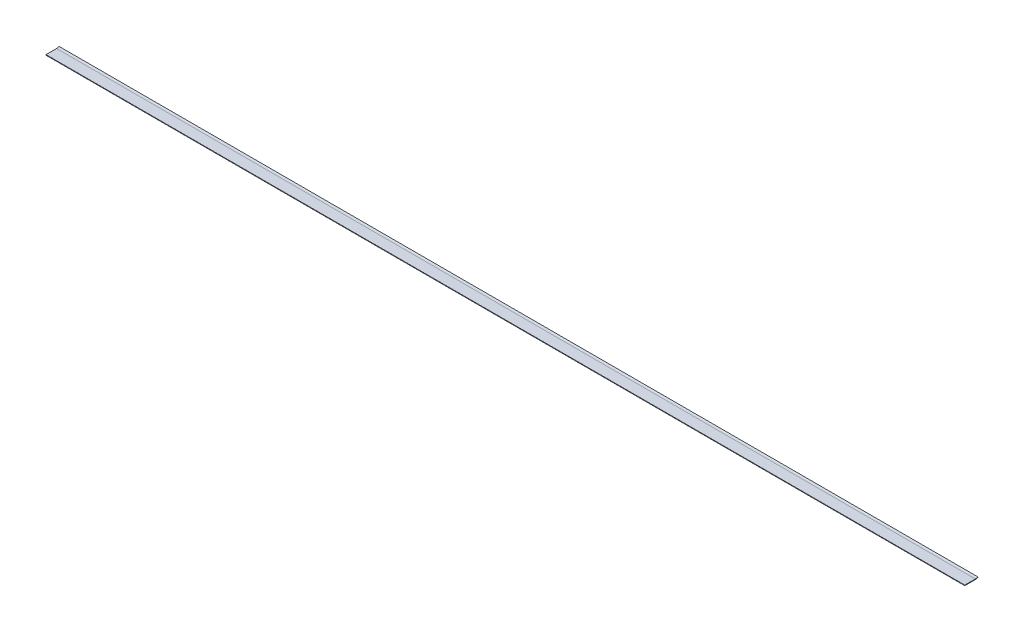
ISO-10303-21;
HEADER;
FILE_DESCRIPTION(('STEP AP214'),'2;1');
FILE_NAME('part.step','',(''),(''),'','','');
FILE_SCHEMA(('AUTOMOTIVE_DESIGN { 1 0 10303 214 1 1 1 1 }'));
ENDSEC;
DATA;
#1=APPLICATION_CONTEXT('core data for automotive mechanical design processes');
#2=APPLICATION_PROTOCOL_DEFINITION('international standard','automotive_design',2000,#1);
#3=PRODUCT_CONTEXT('',#1,'mechanical');
#4=PRODUCT('Part','Part','',(#3));
#5=PRODUCT_RELATED_PRODUCT_CATEGORY('part','',(#4));
#6=PRODUCT_DEFINITION_FORMATION('','',#4);
#7=PRODUCT_DEFINITION_CONTEXT('part definition',#1,'design');
#8=PRODUCT_DEFINITION('design','',#6,#7);
#9=PRODUCT_DEFINITION_SHAPE('','',#8);
#10=(LENGTH_UNIT() NAMED_UNIT(*) SI_UNIT(.MILLI.,.METRE.));
#11=(NAMED_UNIT(*) PLANE_ANGLE_UNIT() SI_UNIT($,.RADIAN.));
#12=(NAMED_UNIT(*) SI_UNIT($,.STERADIAN.) SOLID_ANGLE_UNIT());
#13=UNCERTAINTY_MEASURE_WITH_UNIT(LENGTH_MEASURE(1.E-05),#10,'distance_accuracy_value','');
#14=(GEOMETRIC_REPRESENTATION_CONTEXT(3) GLOBAL_UNCERTAINTY_ASSIGNED_CONTEXT((#13)) GLOBAL_UNIT_ASSIGNED_CONTEXT((#10,
#11,#12)) REPRESENTATION_CONTEXT('',''));
#15=CARTESIAN_POINT('',(0.,0.,0.));
#16=DIRECTION('',(0.,0.,1.));
#17=DIRECTION('',(1.,0.,0.));
#18=AXIS2_PLACEMENT_3D('',#15,#16,#17);
#19=CARTESIAN_POINT('',(-217.4875,0.127000000000002,0.));
#20=DIRECTION('',(0.,1.,0.));
#21=DIRECTION('',(0.,0.,1.));
#22=AXIS2_PLACEMENT_3D('',#19,#20,#21);
#23=PLANE('',#22);
#24=DIRECTION('',(0.,0.,-1.));
#25=VECTOR('',#24,1.);
#26=CARTESIAN_POINT('',(0.,0.127000000000002,0.));
#27=LINE('',#26,#25);
#28=CARTESIAN_POINT('',(0.,0.127000000000002,0.));
#29=VERTEX_POINT('',#28);
#30=CARTESIAN_POINT('',(0.,0.126999999999995,2.51460000000001));
#31=VERTEX_POINT('',#30);
#32=EDGE_CURVE('E123',#29,#31,#27,.F.);
#33=ORIENTED_EDGE('',*,*,#32,.F.);
#34=DIRECTION('',(1.,0.,0.));
#35=VECTOR('',#34,1.);
#36=CARTESIAN_POINT('',(-217.4875,0.127000000000002,0.));
#37=LINE('',#36,#35);
#38=CARTESIAN_POINT('',(-217.4875,0.127000000000002,0.));
#39=VERTEX_POINT('',#38);
#40=EDGE_CURVE('E11',#39,#29,#37,.T.);
#41=ORIENTED_EDGE('',*,*,#40,.F.);
#42=DIRECTION('',(0.,0.,-1.));
#43=VECTOR('',#42,1.);
#44=CARTESIAN_POINT('',(-217.4875,0.127000000000002,0.));
#45=LINE('',#44,#43);
#46=CARTESIAN_POINT('',(-217.4875,0.126999999999995,2.51460000000002));
#47=VERTEX_POINT('',#46);
#48=EDGE_CURVE('E142',#39,#47,#45,.F.);
#49=ORIENTED_EDGE('',*,*,#48,.T.);
#50=DIRECTION('',(1.,0.,0.));
#51=VECTOR('',#50,1.);
#52=CARTESIAN_POINT('',(-217.4875,0.126999999999995,2.51460000000002));
#53=LINE('',#52,#51);
#54=EDGE_CURVE('E37',#47,#31,#53,.T.);
#55=ORIENTED_EDGE('',*,*,#54,.T.);
#56=EDGE_LOOP('',(#33,#41,#49,#55));
#57=FACE_BOUND('',#56,.T.);
#58=ADVANCED_FACE('F34',(#57),#23,.T.);
#59=CARTESIAN_POINT('',(-217.4875,1.016,-2.08166817117217E-13));
#60=DIRECTION('',(1.,0.,0.));
#61=DIRECTION('',(0.,0.,-1.));
#62=AXIS2_PLACEMENT_3D('',#59,#60,#61);
#63=CYLINDRICAL_SURFACE('',#62,0.889);
#64=CARTESIAN_POINT('',(0.,1.016,-2.22044604925031E-13));
#65=DIRECTION('',(1.,0.,0.));
#66=DIRECTION('',(0.,0.,-1.));
#67=AXIS2_PLACEMENT_3D('',#64,#65,#66);
#68=CIRCLE('',#67,0.889);
#69=CARTESIAN_POINT('',(0.,0.308281503089897,-0.538010714699333));
#70=VERTEX_POINT('',#69);
#71=EDGE_CURVE('E139',#70,#29,#68,.F.);
#72=ORIENTED_EDGE('',*,*,#71,.F.);
#73=DIRECTION('',(1.,0.,0.));
#74=VECTOR('',#73,1.);
#75=CARTESIAN_POINT('',(-217.4875,0.308281503089897,-0.538010714699319));
#76=LINE('',#75,#74);
#77=CARTESIAN_POINT('',(-217.4875,0.308281503089897,-0.538010714699319));
#78=VERTEX_POINT('',#77);
#79=EDGE_CURVE('E44',#78,#70,#76,.T.);
#80=ORIENTED_EDGE('',*,*,#79,.F.);
#81=CARTESIAN_POINT('',(-217.4875,1.016,-2.08166817117217E-13));
#82=DIRECTION('',(1.,0.,0.));
#83=DIRECTION('',(0.,0.,-1.));
#84=AXIS2_PLACEMENT_3D('',#81,#82,#83);
#85=CIRCLE('',#84,0.889);
#86=EDGE_CURVE('E98',#78,#39,#85,.F.);
#87=ORIENTED_EDGE('',*,*,#86,.T.);
#88=ORIENTED_EDGE('',*,*,#40,.T.);
#89=EDGE_LOOP('',(#72,#80,#87,#88));
#90=FACE_BOUND('',#89,.T.);
#91=ADVANCED_FACE('F160',(#90),#63,.F.);
#92=CARTESIAN_POINT('',(-217.4875,0.308281503089897,-0.538010714699319));
#93=DIRECTION('',(0.,-0.60518640573604,0.796083798549056));
#94=DIRECTION('',(0.,-0.796083798549056,-0.60518640573604));
#95=AXIS2_PLACEMENT_3D('',#92,#93,#94);
#96=PLANE('',#95);
#97=DIRECTION('',(0.,-0.796083798549056,-0.60518640573604));
#98=VECTOR('',#97,1.);
#99=CARTESIAN_POINT('',(0.,0.308281503089897,-0.538010714699333));
#100=LINE('',#99,#98);
#101=CARTESIAN_POINT('',(0.,0.207178860674159,-0.614869388227815));
#102=VERTEX_POINT('',#101);
#103=EDGE_CURVE('E104',#70,#102,#100,.T.);
#104=ORIENTED_EDGE('',*,*,#103,.T.);
#105=DIRECTION('',(1.,0.,0.));
#106=VECTOR('',#105,1.);
#107=CARTESIAN_POINT('',(-217.4875,0.207178860674159,-0.614869388227801));
#108=LINE('',#107,#106);
#109=CARTESIAN_POINT('',(-217.4875,0.207178860674159,-0.614869388227801));
#110=VERTEX_POINT('',#109);
#111=EDGE_CURVE('E102',#110,#102,#108,.T.);
#112=ORIENTED_EDGE('',*,*,#111,.F.);
#113=DIRECTION('',(0.,-0.796083798549056,-0.60518640573604));
#114=VECTOR('',#113,1.);
#115=CARTESIAN_POINT('',(-217.4875,0.308281503089897,-0.538010714699319));
#116=LINE('',#115,#114);
#117=EDGE_CURVE('E92',#78,#110,#116,.T.);
#118=ORIENTED_EDGE('',*,*,#117,.F.);
#119=ORIENTED_EDGE('',*,*,#79,.T.);
#120=EDGE_LOOP('',(#104,#112,#118,#119));
#121=FACE_BOUND('',#120,.T.);
#122=ADVANCED_FACE('F103',(#121),#96,.F.);
#123=CARTESIAN_POINT('',(-217.4875,1.016,-2.08166817117217E-13));
#124=DIRECTION('',(1.,0.,0.));
#125=DIRECTION('',(0.,0.,-1.));
#126=AXIS2_PLACEMENT_3D('',#123,#124,#125);
#127=CYLINDRICAL_SURFACE('',#126,1.016);
#128=CARTESIAN_POINT('',(0.,1.016,-2.22044604925031E-13));
#129=DIRECTION('',(-1.,0.,0.));
#130=DIRECTION('',(0.,0.,-1.));
#131=AXIS2_PLACEMENT_3D('',#128,#129,#130);
#132=CIRCLE('',#131,1.016);
#133=CARTESIAN_POINT('',(0.,0.,0.));
#134=VERTEX_POINT('',#133);
#135=EDGE_CURVE('E134',#102,#134,#132,.T.);
#136=ORIENTED_EDGE('',*,*,#135,.T.);
#137=DIRECTION('',(1.,0.,0.));
#138=VECTOR('',#137,1.);
#139=CARTESIAN_POINT('',(-217.4875,0.,0.));
#140=LINE('',#139,#138);
#141=CARTESIAN_POINT('',(-217.4875,0.,0.));
#142=VERTEX_POINT('',#141);
#143=EDGE_CURVE('E108',#142,#134,#140,.T.);
#144=ORIENTED_EDGE('',*,*,#143,.F.);
#145=CARTESIAN_POINT('',(-217.4875,1.016,-2.08166817117217E-13));
#146=DIRECTION('',(-1.,0.,0.));
#147=DIRECTION('',(0.,0.,-1.));
#148=AXIS2_PLACEMENT_3D('',#145,#146,#147);
#149=CIRCLE('',#148,1.016);
#150=EDGE_CURVE('E96',#110,#142,#149,.T.);
#151=ORIENTED_EDGE('',*,*,#150,.F.);
#152=ORIENTED_EDGE('',*,*,#111,.T.);
#153=EDGE_LOOP('',(#136,#144,#151,#152));
#154=FACE_BOUND('',#153,.T.);
#155=ADVANCED_FACE('F110',(#154),#127,.T.);
#156=CARTESIAN_POINT('',(-217.4875,0.,0.));
#157=DIRECTION('',(0.,1.,0.));
#158=DIRECTION('',(0.,0.,1.));
#159=AXIS2_PLACEMENT_3D('',#156,#157,#158);
#160=PLANE('',#159);
#161=DIRECTION('',(0.,0.,1.));
#162=VECTOR('',#161,1.);
#163=CARTESIAN_POINT('',(0.,0.,0.));
#164=LINE('',#163,#162);
#165=CARTESIAN_POINT('',(0.,0.,2.51460000000001));
#166=VERTEX_POINT('',#165);
#167=EDGE_CURVE('E131',#134,#166,#164,.T.);
#168=ORIENTED_EDGE('',*,*,#167,.T.);
#169=DIRECTION('',(1.,0.,0.));
#170=VECTOR('',#169,1.);
#171=CARTESIAN_POINT('',(-217.4875,0.,2.51460000000001));
#172=LINE('',#171,#170);
#173=CARTESIAN_POINT('',(-217.4875,0.,2.51460000000001));
#174=VERTEX_POINT('',#173);
#175=EDGE_CURVE('E147',#174,#166,#172,.T.);
#176=ORIENTED_EDGE('',*,*,#175,.F.);
#177=DIRECTION('',(0.,0.,1.));
#178=VECTOR('',#177,1.);
#179=CARTESIAN_POINT('',(-217.4875,0.,0.));
#180=LINE('',#179,#178);
#181=EDGE_CURVE('E114',#142,#174,#180,.T.);
#182=ORIENTED_EDGE('',*,*,#181,.F.);
#183=ORIENTED_EDGE('',*,*,#143,.T.);
#184=EDGE_LOOP('',(#168,#176,#182,#183));
#185=FACE_BOUND('',#184,.T.);
#186=ADVANCED_FACE('F173',(#185),#160,.F.);
#187=CARTESIAN_POINT('',(-217.4875,0.,2.51460000000001));
#188=DIRECTION('',(0.,0.,-1.));
#189=DIRECTION('',(-1.,0.,0.));
#190=AXIS2_PLACEMENT_3D('',#187,#188,#189);
#191=PLANE('',#190);
#192=DIRECTION('',(0.,1.,0.));
#193=VECTOR('',#192,1.);
#194=CARTESIAN_POINT('',(0.,0.,2.51460000000001));
#195=LINE('',#194,#193);
#196=EDGE_CURVE('E127',#166,#31,#195,.T.);
#197=ORIENTED_EDGE('',*,*,#196,.T.);
#198=ORIENTED_EDGE('',*,*,#54,.F.);
#199=DIRECTION('',(0.,1.,0.));
#200=VECTOR('',#199,1.);
#201=CARTESIAN_POINT('',(-217.4875,0.,2.51460000000001));
#202=LINE('',#201,#200);
#203=EDGE_CURVE('E84',#174,#47,#202,.T.);
#204=ORIENTED_EDGE('',*,*,#203,.F.);
#205=ORIENTED_EDGE('',*,*,#175,.T.);
#206=EDGE_LOOP('',(#197,#198,#204,#205));
#207=FACE_BOUND('',#206,.T.);
#208=ADVANCED_FACE('F156',(#207),#191,.F.);
#209=CARTESIAN_POINT('',(-217.4875,1.016,-2.08166817117217E-13));
#210=DIRECTION('',(-1.,0.,0.));
#211=DIRECTION('',(0.,0.,1.));
#212=AXIS2_PLACEMENT_3D('',#209,#210,#211);
#213=PLANE('',#212);
#214=ORIENTED_EDGE('',*,*,#48,.F.);
#215=ORIENTED_EDGE('',*,*,#86,.F.);
#216=ORIENTED_EDGE('',*,*,#117,.T.);
#217=ORIENTED_EDGE('',*,*,#150,.T.);
#218=ORIENTED_EDGE('',*,*,#181,.T.);
#219=ORIENTED_EDGE('',*,*,#203,.T.);
#220=EDGE_LOOP('',(#214,#215,#216,#217,#218,#219));
#221=FACE_BOUND('',#220,.T.);
#222=ADVANCED_FACE('F94',(#221),#213,.T.);
#223=CARTESIAN_POINT('',(0.,1.016,-2.22044604925031E-13));
#224=DIRECTION('',(-1.,0.,0.));
#225=DIRECTION('',(0.,0.,1.));
#226=AXIS2_PLACEMENT_3D('',#223,#224,#225);
#227=PLANE('',#226);
#228=ORIENTED_EDGE('',*,*,#32,.T.);
#229=ORIENTED_EDGE('',*,*,#196,.F.);
#230=ORIENTED_EDGE('',*,*,#167,.F.);
#231=ORIENTED_EDGE('',*,*,#135,.F.);
#232=ORIENTED_EDGE('',*,*,#103,.F.);
#233=ORIENTED_EDGE('',*,*,#71,.T.);
#234=EDGE_LOOP('',(#228,#229,#230,#231,#232,#233));
#235=FACE_BOUND('',#234,.T.);
#236=ADVANCED_FACE('F159',(#235),#227,.F.);
#237=CLOSED_SHELL('',(#58,#91,#122,#155,#186,#208,#222,#236));
#238=MANIFOLD_SOLID_BREP('B2',#237);
#239=ADVANCED_BREP_SHAPE_REPRESENTATION('',(#18,#238),#14);
#240=SHAPE_DEFINITION_REPRESENTATION(#9,#239);
ENDSEC;
END-ISO-10303-21;
